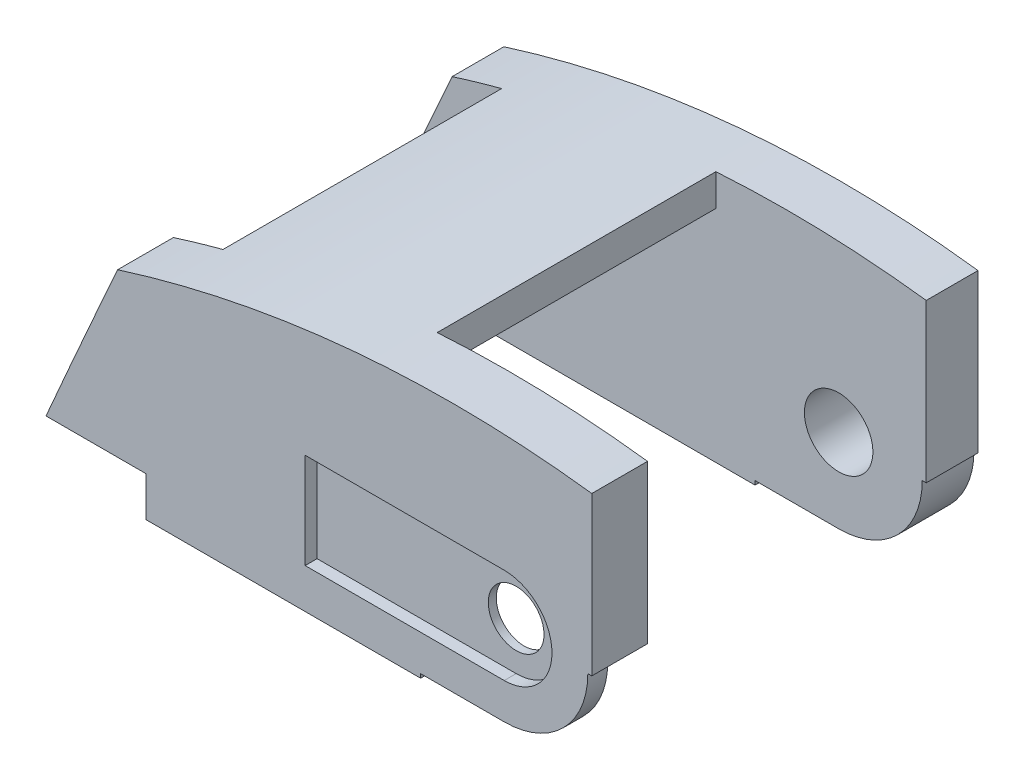
ISO-10303-21;
HEADER;
FILE_DESCRIPTION(('STEP AP214'),'2;1');
FILE_NAME('part.step','',(''),(''),'','','');
FILE_SCHEMA(('AUTOMOTIVE_DESIGN { 1 0 10303 214 1 1 1 1 }'));
ENDSEC;
DATA;
#1=APPLICATION_CONTEXT('core data for automotive mechanical design processes');
#2=APPLICATION_PROTOCOL_DEFINITION('international standard','automotive_design',2000,#1);
#3=PRODUCT_CONTEXT('',#1,'mechanical');
#4=PRODUCT('Part','Part','',(#3));
#5=PRODUCT_RELATED_PRODUCT_CATEGORY('part','',(#4));
#6=PRODUCT_DEFINITION_FORMATION('','',#4);
#7=PRODUCT_DEFINITION_CONTEXT('part definition',#1,'design');
#8=PRODUCT_DEFINITION('design','',#6,#7);
#9=PRODUCT_DEFINITION_SHAPE('','',#8);
#10=(LENGTH_UNIT() NAMED_UNIT(*) SI_UNIT(.MILLI.,.METRE.));
#11=(NAMED_UNIT(*) PLANE_ANGLE_UNIT() SI_UNIT($,.RADIAN.));
#12=(NAMED_UNIT(*) SI_UNIT($,.STERADIAN.) SOLID_ANGLE_UNIT());
#13=UNCERTAINTY_MEASURE_WITH_UNIT(LENGTH_MEASURE(1.E-05),#10,'distance_accuracy_value','');
#14=(GEOMETRIC_REPRESENTATION_CONTEXT(3) GLOBAL_UNCERTAINTY_ASSIGNED_CONTEXT((#13)) GLOBAL_UNIT_ASSIGNED_CONTEXT((#10,
#11,#12)) REPRESENTATION_CONTEXT('',''));
#15=CARTESIAN_POINT('',(0.,0.,0.));
#16=DIRECTION('',(0.,0.,1.));
#17=DIRECTION('',(1.,0.,0.));
#18=AXIS2_PLACEMENT_3D('',#15,#16,#17);
#19=CARTESIAN_POINT('',(0.,0.,-21.75));
#20=DIRECTION('',(0.,0.,1.));
#21=DIRECTION('',(-1.,0.,0.));
#22=AXIS2_PLACEMENT_3D('',#19,#20,#21);
#23=CYLINDRICAL_SURFACE('',#22,3.5);
#24=CARTESIAN_POINT('',(0.,0.,-2.5));
#25=DIRECTION('',(0.,0.,1.));
#26=DIRECTION('',(0.,-1.,0.));
#27=AXIS2_PLACEMENT_3D('',#24,#25,#26);
#28=CIRCLE('',#27,3.5);
#29=CARTESIAN_POINT('',(0.,-3.5,-2.5));
#30=VERTEX_POINT('',#29);
#31=EDGE_CURVE('E311',#30,#30,#28,.T.);
#32=ORIENTED_EDGE('',*,*,#31,.F.);
#33=EDGE_LOOP('',(#32));
#34=FACE_BOUND('',#33,.T.);
#35=CARTESIAN_POINT('',(0.,0.,-1.5));
#36=DIRECTION('',(0.,0.,-1.));
#37=DIRECTION('',(-1.,0.,0.));
#38=AXIS2_PLACEMENT_3D('',#35,#36,#37);
#39=CIRCLE('',#38,3.5);
#40=CARTESIAN_POINT('',(-3.5,0.,-1.5));
#41=VERTEX_POINT('',#40);
#42=EDGE_CURVE('E53',#41,#41,#39,.F.);
#43=ORIENTED_EDGE('',*,*,#42,.T.);
#44=EDGE_LOOP('',(#43));
#45=FACE_BOUND('',#44,.T.);
#46=ADVANCED_FACE('F49',(#34,#45),#23,.F.);
#47=CARTESIAN_POINT('',(12.,-12.,-7.));
#48=DIRECTION('',(0.,0.,1.));
#49=DIRECTION('',(0.,-1.,0.));
#50=AXIS2_PLACEMENT_3D('',#47,#48,#49);
#51=PLANE('',#50);
#52=CARTESIAN_POINT('',(0.,0.,-7.));
#53=DIRECTION('',(0.,0.,-1.));
#54=DIRECTION('',(0.,1.,0.));
#55=AXIS2_PLACEMENT_3D('',#52,#53,#54);
#56=CIRCLE('',#55,9.5);
#57=CARTESIAN_POINT('',(-9.5,0.,-7.));
#58=VERTEX_POINT('',#57);
#59=CARTESIAN_POINT('',(9.5,0.,-7.));
#60=VERTEX_POINT('',#59);
#61=EDGE_CURVE('E546',#58,#60,#56,.T.);
#62=ORIENTED_EDGE('',*,*,#61,.F.);
#63=DIRECTION('',(0.,1.,0.));
#64=VECTOR('',#63,1.);
#65=CARTESIAN_POINT('',(-9.5,-12.,-7.));
#66=LINE('',#65,#64);
#67=CARTESIAN_POINT('',(-9.5,-10.5,-7.00000000000001));
#68=VERTEX_POINT('',#67);
#69=EDGE_CURVE('E324',#68,#58,#66,.T.);
#70=ORIENTED_EDGE('',*,*,#69,.F.);
#71=DIRECTION('',(-1.,0.,0.));
#72=VECTOR('',#71,1.);
#73=CARTESIAN_POINT('',(12.,-10.5,-7.));
#74=LINE('',#73,#72);
#75=CARTESIAN_POINT('',(-10.5,-10.5,-7.00000000000001));
#76=VERTEX_POINT('',#75);
#77=EDGE_CURVE('E395',#68,#76,#74,.T.);
#78=ORIENTED_EDGE('',*,*,#77,.T.);
#79=DIRECTION('',(0.,-1.,0.));
#80=VECTOR('',#79,1.);
#81=CARTESIAN_POINT('',(-10.5,-12.,-7.));
#82=LINE('',#81,#80);
#83=CARTESIAN_POINT('',(-10.5,-11.,-7.00000000000001));
#84=VERTEX_POINT('',#83);
#85=EDGE_CURVE('E391',#76,#84,#82,.T.);
#86=ORIENTED_EDGE('',*,*,#85,.T.);
#87=DIRECTION('',(-1.,0.,0.));
#88=VECTOR('',#87,1.);
#89=CARTESIAN_POINT('',(0.,-11.,-7.));
#90=LINE('',#89,#88);
#91=CARTESIAN_POINT('',(-45.,-11.,-6.99999999999999));
#92=VERTEX_POINT('',#91);
#93=EDGE_CURVE('E522',#84,#92,#90,.T.);
#94=ORIENTED_EDGE('',*,*,#93,.T.);
#95=DIRECTION('',(0.,1.,0.));
#96=VECTOR('',#95,1.);
#97=CARTESIAN_POINT('',(-45.,-12.,-7.));
#98=LINE('',#97,#96);
#99=CARTESIAN_POINT('',(-45.,-6.00000000000001,-7.));
#100=VERTEX_POINT('',#99);
#101=EDGE_CURVE('E505',#92,#100,#98,.T.);
#102=ORIENTED_EDGE('',*,*,#101,.T.);
#103=DIRECTION('',(-1.,0.,0.));
#104=VECTOR('',#103,1.);
#105=CARTESIAN_POINT('',(12.,-6.00000000000001,-7.));
#106=LINE('',#105,#104);
#107=CARTESIAN_POINT('',(-57.544,-6.00000000000001,-7.));
#108=VERTEX_POINT('',#107);
#109=EDGE_CURVE('E501',#100,#108,#106,.T.);
#110=ORIENTED_EDGE('',*,*,#109,.T.);
#111=CARTESIAN_POINT('',(1474.51463993777,-669.474162441972,-7.));
#112=DIRECTION('',(0.,0.,-1.));
#113=DIRECTION('',(-1.,0.,0.));
#114=AXIS2_PLACEMENT_3D('',#111,#112,#113);
#115=CIRCLE('',#114,1669.55132908098);
#116=CARTESIAN_POINT('',(-48.5440000000004,14.4074206899005,-7.));
#117=VERTEX_POINT('',#116);
#118=EDGE_CURVE('E561',#108,#117,#115,.T.);
#119=ORIENTED_EDGE('',*,*,#118,.T.);
#120=CARTESIAN_POINT('',(-6.37755228058483,-118.72612320149,-7.00000000000001));
#121=DIRECTION('',(0.,0.,-1.));
#122=DIRECTION('',(-1.,0.,0.));
#123=AXIS2_PLACEMENT_3D('',#120,#121,#122);
#124=CIRCLE('',#123,139.651529967828);
#125=CARTESIAN_POINT('',(-42.3185543882278,16.2212524300997,-7.00000000000001));
#126=VERTEX_POINT('',#125);
#127=EDGE_CURVE('E419',#126,#117,#124,.F.);
#128=ORIENTED_EDGE('',*,*,#127,.F.);
#129=DIRECTION('',(0.,-1.,0.));
#130=VECTOR('',#129,1.);
#131=CARTESIAN_POINT('',(-42.3185543882278,23.1968454989127,-7.));
#132=LINE('',#131,#130);
#133=CARTESIAN_POINT('',(-42.3185543882278,10.887159644469,-7.));
#134=VERTEX_POINT('',#133);
#135=EDGE_CURVE('E399',#126,#134,#132,.T.);
#136=ORIENTED_EDGE('',*,*,#135,.T.);
#137=CARTESIAN_POINT('',(-6.54760474938378,-90.7897246312211,-6.99999999999999));
#138=DIRECTION('',(0.,0.,-1.));
#139=DIRECTION('',(0.,1.,0.));
#140=AXIS2_PLACEMENT_3D('',#137,#138,#139);
#141=CIRCLE('',#140,107.785665253209);
#142=CARTESIAN_POINT('',(-15.4186813659914,16.6302624928661,-7.));
#143=VERTEX_POINT('',#142);
#144=EDGE_CURVE('E453',#143,#134,#141,.F.);
#145=ORIENTED_EDGE('',*,*,#144,.F.);
#146=DIRECTION('',(0.,1.,0.));
#147=VECTOR('',#146,1.);
#148=CARTESIAN_POINT('',(-15.4186813659914,25.0924741347079,-7.));
#149=LINE('',#148,#147);
#150=CARTESIAN_POINT('',(-15.4186813659914,20.6324352268174,-7.00000000000001));
#151=VERTEX_POINT('',#150);
#152=EDGE_CURVE('E404',#143,#151,#149,.T.);
#153=ORIENTED_EDGE('',*,*,#152,.T.);
#154=CARTESIAN_POINT('',(-6.37755228058483,-118.72612320149,-7.00000000000001));
#155=DIRECTION('',(0.,0.,-1.));
#156=DIRECTION('',(-1.,0.,0.));
#157=AXIS2_PLACEMENT_3D('',#154,#155,#156);
#158=CIRCLE('',#157,139.651529967828);
#159=CARTESIAN_POINT('',(11.,19.84,-7.00000000000001));
#160=VERTEX_POINT('',#159);
#161=EDGE_CURVE('E430',#160,#151,#158,.F.);
#162=ORIENTED_EDGE('',*,*,#161,.F.);
#163=DIRECTION('',(0.,-1.,0.));
#164=VECTOR('',#163,1.);
#165=CARTESIAN_POINT('',(11.,-12.,-7.));
#166=LINE('',#165,#164);
#167=CARTESIAN_POINT('',(11.,0.,-7.00000000000003));
#168=VERTEX_POINT('',#167);
#169=EDGE_CURVE('E541',#160,#168,#166,.T.);
#170=ORIENTED_EDGE('',*,*,#169,.T.);
#171=DIRECTION('',(-1.,0.,0.));
#172=VECTOR('',#171,1.);
#173=CARTESIAN_POINT('',(12.,0.,-7.));
#174=LINE('',#173,#172);
#175=EDGE_CURVE('E383',#168,#60,#174,.T.);
#176=ORIENTED_EDGE('',*,*,#175,.T.);
#177=EDGE_LOOP('',(#62,#70,#78,#86,#94,#102,#110,#119,#128,#136,#145,#153,#162,#170,#176));
#178=FACE_BOUND('',#177,.T.);
#179=ADVANCED_FACE('F605',(#178),#51,.F.);
#180=CARTESIAN_POINT('',(0.,0.,0.));
#181=DIRECTION('',(0.,0.,1.));
#182=DIRECTION('',(1.,0.,0.));
#183=AXIS2_PLACEMENT_3D('',#180,#181,#182);
#184=PLANE('',#183);
#185=CARTESIAN_POINT('',(0.,0.,0.));
#186=DIRECTION('',(0.,0.,-1.));
#187=DIRECTION('',(-1.,0.,0.));
#188=AXIS2_PLACEMENT_3D('',#185,#186,#187);
#189=CIRCLE('',#188,6.);
#190=CARTESIAN_POINT('',(0.,6.,0.));
#191=VERTEX_POINT('',#190);
#192=CARTESIAN_POINT('',(0.,-6.,0.));
#193=VERTEX_POINT('',#192);
#194=EDGE_CURVE('E291',#191,#193,#189,.T.);
#195=ORIENTED_EDGE('',*,*,#194,.T.);
#196=DIRECTION('',(-1.,0.,0.));
#197=VECTOR('',#196,1.);
#198=CARTESIAN_POINT('',(0.,-6.,0.));
#199=LINE('',#198,#197);
#200=CARTESIAN_POINT('',(-25.,-6.,0.));
#201=VERTEX_POINT('',#200);
#202=EDGE_CURVE('E260',#193,#201,#199,.T.);
#203=ORIENTED_EDGE('',*,*,#202,.T.);
#204=DIRECTION('',(0.,1.,0.));
#205=VECTOR('',#204,1.);
#206=CARTESIAN_POINT('',(-25.,6.,0.));
#207=LINE('',#206,#205);
#208=CARTESIAN_POINT('',(-25.,6.,0.));
#209=VERTEX_POINT('',#208);
#210=EDGE_CURVE('E284',#201,#209,#207,.T.);
#211=ORIENTED_EDGE('',*,*,#210,.T.);
#212=DIRECTION('',(1.,0.,0.));
#213=VECTOR('',#212,1.);
#214=CARTESIAN_POINT('',(0.,6.,0.));
#215=LINE('',#214,#213);
#216=EDGE_CURVE('E280',#209,#191,#215,.T.);
#217=ORIENTED_EDGE('',*,*,#216,.T.);
#218=EDGE_LOOP('',(#195,#203,#211,#217));
#219=FACE_BOUND('',#218,.T.);
#220=DIRECTION('',(-1.,0.,0.));
#221=VECTOR('',#220,1.);
#222=CARTESIAN_POINT('',(0.,-10.5,0.));
#223=LINE('',#222,#221);
#224=CARTESIAN_POINT('',(0.,-10.5,0.));
#225=VERTEX_POINT('',#224);
#226=CARTESIAN_POINT('',(-10.5,-10.5,0.));
#227=VERTEX_POINT('',#226);
#228=EDGE_CURVE('E338',#225,#227,#223,.T.);
#229=ORIENTED_EDGE('',*,*,#228,.F.);
#230=CARTESIAN_POINT('',(0.,0.,0.));
#231=DIRECTION('',(0.,0.,-1.));
#232=DIRECTION('',(-1.,0.,0.));
#233=AXIS2_PLACEMENT_3D('',#230,#231,#232);
#234=CIRCLE('',#233,10.5);
#235=CARTESIAN_POINT('',(10.5,0.,0.));
#236=VERTEX_POINT('',#235);
#237=EDGE_CURVE('E351',#236,#225,#234,.T.);
#238=ORIENTED_EDGE('',*,*,#237,.F.);
#239=DIRECTION('',(-1.,0.,0.));
#240=VECTOR('',#239,1.);
#241=CARTESIAN_POINT('',(0.,0.,0.));
#242=LINE('',#241,#240);
#243=CARTESIAN_POINT('',(11.,0.,0.));
#244=VERTEX_POINT('',#243);
#245=EDGE_CURVE('E354',#244,#236,#242,.T.);
#246=ORIENTED_EDGE('',*,*,#245,.F.);
#247=DIRECTION('',(0.,-1.,0.));
#248=VECTOR('',#247,1.);
#249=CARTESIAN_POINT('',(11.,0.,0.));
#250=LINE('',#249,#248);
#251=CARTESIAN_POINT('',(11.,19.84,0.));
#252=VERTEX_POINT('',#251);
#253=EDGE_CURVE('E526',#252,#244,#250,.T.);
#254=ORIENTED_EDGE('',*,*,#253,.F.);
#255=CARTESIAN_POINT('',(-6.37755228058483,-118.72612320149,0.));
#256=DIRECTION('',(0.,0.,-1.));
#257=DIRECTION('',(-1.,0.,0.));
#258=AXIS2_PLACEMENT_3D('',#255,#256,#257);
#259=CIRCLE('',#258,139.651529967828);
#260=CARTESIAN_POINT('',(-48.544,14.4074206899005,0.));
#261=VERTEX_POINT('',#260);
#262=EDGE_CURVE('E469',#261,#252,#259,.T.);
#263=ORIENTED_EDGE('',*,*,#262,.F.);
#264=CARTESIAN_POINT('',(1474.51463993777,-669.474162441972,0.));
#265=DIRECTION('',(0.,0.,-1.));
#266=DIRECTION('',(-1.,0.,0.));
#267=AXIS2_PLACEMENT_3D('',#264,#265,#266);
#268=CIRCLE('',#267,1669.55132908098);
#269=CARTESIAN_POINT('',(-57.544,-6.00000000000001,0.));
#270=VERTEX_POINT('',#269);
#271=EDGE_CURVE('E437',#261,#270,#268,.F.);
#272=ORIENTED_EDGE('',*,*,#271,.T.);
#273=DIRECTION('',(1.,0.,0.));
#274=VECTOR('',#273,1.);
#275=CARTESIAN_POINT('',(-55.,-6.,0.));
#276=LINE('',#275,#274);
#277=CARTESIAN_POINT('',(-45.,-6.00000000000001,0.));
#278=VERTEX_POINT('',#277);
#279=EDGE_CURVE('E474',#270,#278,#276,.T.);
#280=ORIENTED_EDGE('',*,*,#279,.T.);
#281=DIRECTION('',(0.,-1.,0.));
#282=VECTOR('',#281,1.);
#283=CARTESIAN_POINT('',(-45.,-11.,0.));
#284=LINE('',#283,#282);
#285=CARTESIAN_POINT('',(-45.,-11.,0.));
#286=VERTEX_POINT('',#285);
#287=EDGE_CURVE('E478',#278,#286,#284,.T.);
#288=ORIENTED_EDGE('',*,*,#287,.T.);
#289=DIRECTION('',(-1.,0.,0.));
#290=VECTOR('',#289,1.);
#291=CARTESIAN_POINT('',(0.,-11.,0.));
#292=LINE('',#291,#290);
#293=CARTESIAN_POINT('',(-10.5,-11.,0.));
#294=VERTEX_POINT('',#293);
#295=EDGE_CURVE('E521',#294,#286,#292,.T.);
#296=ORIENTED_EDGE('',*,*,#295,.F.);
#297=DIRECTION('',(0.,-1.,0.));
#298=VECTOR('',#297,1.);
#299=CARTESIAN_POINT('',(-10.5,0.,0.));
#300=LINE('',#299,#298);
#301=EDGE_CURVE('E358',#227,#294,#300,.T.);
#302=ORIENTED_EDGE('',*,*,#301,.F.);
#303=EDGE_LOOP('',(#229,#238,#246,#254,#263,#272,#280,#288,#296,#302));
#304=FACE_BOUND('',#303,.T.);
#305=ADVANCED_FACE('F611',(#219,#304),#184,.T.);
#306=CARTESIAN_POINT('',(0.,0.,-48.5));
#307=DIRECTION('',(0.,0.,-1.));
#308=DIRECTION('',(-1.,0.,0.));
#309=AXIS2_PLACEMENT_3D('',#306,#307,#308);
#310=PLANE('',#309);
#311=CARTESIAN_POINT('',(0.,0.,-48.5));
#312=DIRECTION('',(0.,0.,-1.));
#313=DIRECTION('',(-1.,0.,0.));
#314=AXIS2_PLACEMENT_3D('',#311,#312,#313);
#315=CIRCLE('',#314,4.3);
#316=CARTESIAN_POINT('',(-4.3,0.,-48.5));
#317=VERTEX_POINT('',#316);
#318=EDGE_CURVE('E328',#317,#317,#315,.T.);
#319=ORIENTED_EDGE('',*,*,#318,.F.);
#320=EDGE_LOOP('',(#319));
#321=FACE_BOUND('',#320,.T.);
#322=DIRECTION('',(-1.,0.,0.));
#323=VECTOR('',#322,1.);
#324=CARTESIAN_POINT('',(0.,-11.,-48.5));
#325=LINE('',#324,#323);
#326=CARTESIAN_POINT('',(-10.5,-11.,-48.5));
#327=VERTEX_POINT('',#326);
#328=CARTESIAN_POINT('',(-45.,-11.,-48.5));
#329=VERTEX_POINT('',#328);
#330=EDGE_CURVE('E517',#327,#329,#325,.T.);
#331=ORIENTED_EDGE('',*,*,#330,.T.);
#332=DIRECTION('',(0.,-1.,0.));
#333=VECTOR('',#332,1.);
#334=CARTESIAN_POINT('',(-45.,-11.,-48.5));
#335=LINE('',#334,#333);
#336=CARTESIAN_POINT('',(-45.,-6.00000000000001,-48.5));
#337=VERTEX_POINT('',#336);
#338=EDGE_CURVE('E479',#337,#329,#335,.T.);
#339=ORIENTED_EDGE('',*,*,#338,.F.);
#340=DIRECTION('',(1.,0.,0.));
#341=VECTOR('',#340,1.);
#342=CARTESIAN_POINT('',(-55.,-6.,-48.5));
#343=LINE('',#342,#341);
#344=CARTESIAN_POINT('',(-57.544,-6.00000000000001,-48.5));
#345=VERTEX_POINT('',#344);
#346=EDGE_CURVE('E473',#345,#337,#343,.T.);
#347=ORIENTED_EDGE('',*,*,#346,.F.);
#348=CARTESIAN_POINT('',(1474.51463993777,-669.474162441972,-48.5));
#349=DIRECTION('',(0.,0.,-1.));
#350=DIRECTION('',(-1.,0.,0.));
#351=AXIS2_PLACEMENT_3D('',#348,#349,#350);
#352=CIRCLE('',#351,1669.55132908098);
#353=CARTESIAN_POINT('',(-48.544,14.4074206899005,-48.5));
#354=VERTEX_POINT('',#353);
#355=EDGE_CURVE('E441',#354,#345,#352,.F.);
#356=ORIENTED_EDGE('',*,*,#355,.F.);
#357=CARTESIAN_POINT('',(-6.37755228058483,-118.72612320149,-48.5));
#358=DIRECTION('',(0.,0.,1.));
#359=DIRECTION('',(1.,0.,0.));
#360=AXIS2_PLACEMENT_3D('',#357,#358,#359);
#361=CIRCLE('',#360,139.651529967828);
#362=CARTESIAN_POINT('',(11.,19.84,-48.5));
#363=VERTEX_POINT('',#362);
#364=EDGE_CURVE('E465',#363,#354,#361,.T.);
#365=ORIENTED_EDGE('',*,*,#364,.F.);
#366=DIRECTION('',(0.,-1.,0.));
#367=VECTOR('',#366,1.);
#368=CARTESIAN_POINT('',(11.,0.,-48.5));
#369=LINE('',#368,#367);
#370=CARTESIAN_POINT('',(11.,0.,-48.5));
#371=VERTEX_POINT('',#370);
#372=EDGE_CURVE('E530',#363,#371,#369,.T.);
#373=ORIENTED_EDGE('',*,*,#372,.T.);
#374=DIRECTION('',(-1.,0.,0.));
#375=VECTOR('',#374,1.);
#376=CARTESIAN_POINT('',(0.,0.,-48.5));
#377=LINE('',#376,#375);
#378=CARTESIAN_POINT('',(10.5,0.,-48.5));
#379=VERTEX_POINT('',#378);
#380=EDGE_CURVE('E337',#371,#379,#377,.T.);
#381=ORIENTED_EDGE('',*,*,#380,.T.);
#382=CARTESIAN_POINT('',(0.,0.,-48.5));
#383=DIRECTION('',(0.,0.,-1.));
#384=DIRECTION('',(-1.,0.,0.));
#385=AXIS2_PLACEMENT_3D('',#382,#383,#384);
#386=CIRCLE('',#385,10.5);
#387=CARTESIAN_POINT('',(0.,-10.5,-48.5));
#388=VERTEX_POINT('',#387);
#389=EDGE_CURVE('E333',#379,#388,#386,.T.);
#390=ORIENTED_EDGE('',*,*,#389,.T.);
#391=DIRECTION('',(-1.,0.,0.));
#392=VECTOR('',#391,1.);
#393=CARTESIAN_POINT('',(0.,-10.5,-48.5));
#394=LINE('',#393,#392);
#395=CARTESIAN_POINT('',(-10.5,-10.5,-48.5));
#396=VERTEX_POINT('',#395);
#397=EDGE_CURVE('E346',#388,#396,#394,.T.);
#398=ORIENTED_EDGE('',*,*,#397,.T.);
#399=DIRECTION('',(0.,-1.,0.));
#400=VECTOR('',#399,1.);
#401=CARTESIAN_POINT('',(-10.5,0.,-48.5));
#402=LINE('',#401,#400);
#403=EDGE_CURVE('E342',#396,#327,#402,.T.);
#404=ORIENTED_EDGE('',*,*,#403,.T.);
#405=EDGE_LOOP('',(#331,#339,#347,#356,#365,#373,#381,#390,#398,#404));
#406=FACE_BOUND('',#405,.T.);
#407=ADVANCED_FACE('F675',(#321,#406),#310,.T.);
#408=CARTESIAN_POINT('',(0.,0.,-42.));
#409=DIRECTION('',(0.,0.,1.));
#410=DIRECTION('',(1.,0.,0.));
#411=AXIS2_PLACEMENT_3D('',#408,#409,#410);
#412=PLANE('',#411);
#413=CARTESIAN_POINT('',(0.,0.,-42.));
#414=DIRECTION('',(0.,0.,-1.));
#415=DIRECTION('',(-1.,0.,0.));
#416=AXIS2_PLACEMENT_3D('',#413,#414,#415);
#417=CIRCLE('',#416,4.3);
#418=CARTESIAN_POINT('',(-4.3,0.,-42.));
#419=VERTEX_POINT('',#418);
#420=EDGE_CURVE('E332',#419,#419,#417,.T.);
#421=ORIENTED_EDGE('',*,*,#420,.T.);
#422=EDGE_LOOP('',(#421));
#423=FACE_BOUND('',#422,.T.);
#424=DIRECTION('',(-1.,0.,0.));
#425=VECTOR('',#424,1.);
#426=CARTESIAN_POINT('',(0.,-10.5,-42.));
#427=LINE('',#426,#425);
#428=CARTESIAN_POINT('',(0.,-10.5,-42.));
#429=VERTEX_POINT('',#428);
#430=CARTESIAN_POINT('',(-10.5,-10.5,-42.));
#431=VERTEX_POINT('',#430);
#432=EDGE_CURVE('E575',#429,#431,#427,.T.);
#433=ORIENTED_EDGE('',*,*,#432,.F.);
#434=CARTESIAN_POINT('',(0.,0.,-42.));
#435=DIRECTION('',(0.,0.,-1.));
#436=DIRECTION('',(-1.,0.,0.));
#437=AXIS2_PLACEMENT_3D('',#434,#435,#436);
#438=CIRCLE('',#437,10.5);
#439=CARTESIAN_POINT('',(10.5,0.,-42.));
#440=VERTEX_POINT('',#439);
#441=EDGE_CURVE('E571',#440,#429,#438,.T.);
#442=ORIENTED_EDGE('',*,*,#441,.F.);
#443=DIRECTION('',(-1.,0.,0.));
#444=VECTOR('',#443,1.);
#445=CARTESIAN_POINT('',(0.,0.,-42.));
#446=LINE('',#445,#444);
#447=CARTESIAN_POINT('',(11.,0.,-42.));
#448=VERTEX_POINT('',#447);
#449=EDGE_CURVE('E368',#448,#440,#446,.T.);
#450=ORIENTED_EDGE('',*,*,#449,.F.);
#451=DIRECTION('',(0.,1.,0.));
#452=VECTOR('',#451,1.);
#453=CARTESIAN_POINT('',(11.,0.,-42.));
#454=LINE('',#453,#452);
#455=CARTESIAN_POINT('',(11.,19.84,-42.));
#456=VERTEX_POINT('',#455);
#457=EDGE_CURVE('E509',#448,#456,#454,.T.);
#458=ORIENTED_EDGE('',*,*,#457,.T.);
#459=CARTESIAN_POINT('',(-6.37755228058483,-118.72612320149,-42.));
#460=DIRECTION('',(0.,0.,-1.));
#461=DIRECTION('',(-1.,0.,0.));
#462=AXIS2_PLACEMENT_3D('',#459,#460,#461);
#463=CIRCLE('',#462,139.651529967828);
#464=CARTESIAN_POINT('',(-15.4186813659914,20.6324352268174,-42.));
#465=VERTEX_POINT('',#464);
#466=EDGE_CURVE('E426',#456,#465,#463,.F.);
#467=ORIENTED_EDGE('',*,*,#466,.T.);
#468=DIRECTION('',(0.,1.,0.));
#469=VECTOR('',#468,1.);
#470=CARTESIAN_POINT('',(-15.4186813659914,25.0924741347079,-42.));
#471=LINE('',#470,#469);
#472=CARTESIAN_POINT('',(-15.4186813659914,16.6302624928661,-42.));
#473=VERTEX_POINT('',#472);
#474=EDGE_CURVE('E400',#473,#465,#471,.T.);
#475=ORIENTED_EDGE('',*,*,#474,.F.);
#476=CARTESIAN_POINT('',(-6.54760474938378,-90.7897246312211,-42.));
#477=DIRECTION('',(0.,0.,-1.));
#478=DIRECTION('',(-1.,0.,0.));
#479=AXIS2_PLACEMENT_3D('',#476,#477,#478);
#480=CIRCLE('',#479,107.785665253209);
#481=CARTESIAN_POINT('',(-42.3185543882278,10.887159644469,-42.));
#482=VERTEX_POINT('',#481);
#483=EDGE_CURVE('E449',#473,#482,#480,.F.);
#484=ORIENTED_EDGE('',*,*,#483,.T.);
#485=DIRECTION('',(0.,-1.,0.));
#486=VECTOR('',#485,1.);
#487=CARTESIAN_POINT('',(-42.3185543882278,23.1968454989127,-42.));
#488=LINE('',#487,#486);
#489=CARTESIAN_POINT('',(-42.3185543882278,16.2212524300997,-42.));
#490=VERTEX_POINT('',#489);
#491=EDGE_CURVE('E405',#490,#482,#488,.T.);
#492=ORIENTED_EDGE('',*,*,#491,.F.);
#493=CARTESIAN_POINT('',(-6.37755228058483,-118.72612320149,-42.));
#494=DIRECTION('',(0.,0.,-1.));
#495=DIRECTION('',(-1.,0.,0.));
#496=AXIS2_PLACEMENT_3D('',#493,#494,#495);
#497=CIRCLE('',#496,139.651529967828);
#498=CARTESIAN_POINT('',(-48.5440000000004,14.4074206899005,-42.));
#499=VERTEX_POINT('',#498);
#500=EDGE_CURVE('E409',#490,#499,#497,.F.);
#501=ORIENTED_EDGE('',*,*,#500,.T.);
#502=CARTESIAN_POINT('',(1474.51463993777,-669.474162441972,-42.));
#503=DIRECTION('',(0.,0.,-1.));
#504=DIRECTION('',(-1.,0.,0.));
#505=AXIS2_PLACEMENT_3D('',#502,#503,#504);
#506=CIRCLE('',#505,1669.55132908098);
#507=CARTESIAN_POINT('',(-57.544,-6.00000000000001,-42.));
#508=VERTEX_POINT('',#507);
#509=EDGE_CURVE('E557',#508,#499,#506,.T.);
#510=ORIENTED_EDGE('',*,*,#509,.F.);
#511=DIRECTION('',(-1.,0.,0.));
#512=VECTOR('',#511,1.);
#513=CARTESIAN_POINT('',(0.,-6.00000000000001,-42.));
#514=LINE('',#513,#512);
#515=CARTESIAN_POINT('',(-45.,-6.00000000000001,-42.));
#516=VERTEX_POINT('',#515);
#517=EDGE_CURVE('E493',#516,#508,#514,.T.);
#518=ORIENTED_EDGE('',*,*,#517,.F.);
#519=DIRECTION('',(0.,1.,0.));
#520=VECTOR('',#519,1.);
#521=CARTESIAN_POINT('',(-45.,0.,-42.));
#522=LINE('',#521,#520);
#523=CARTESIAN_POINT('',(-45.,-11.,-42.));
#524=VERTEX_POINT('',#523);
#525=EDGE_CURVE('E550',#524,#516,#522,.T.);
#526=ORIENTED_EDGE('',*,*,#525,.F.);
#527=DIRECTION('',(1.,0.,0.));
#528=VECTOR('',#527,1.);
#529=CARTESIAN_POINT('',(0.,-11.,-42.));
#530=LINE('',#529,#528);
#531=CARTESIAN_POINT('',(-10.5,-11.,-42.));
#532=VERTEX_POINT('',#531);
#533=EDGE_CURVE('E513',#524,#532,#530,.T.);
#534=ORIENTED_EDGE('',*,*,#533,.T.);
#535=DIRECTION('',(0.,-1.,0.));
#536=VECTOR('',#535,1.);
#537=CARTESIAN_POINT('',(-10.5,0.,-42.));
#538=LINE('',#537,#536);
#539=EDGE_CURVE('E387',#431,#532,#538,.T.);
#540=ORIENTED_EDGE('',*,*,#539,.F.);
#541=EDGE_LOOP('',(#433,#442,#450,#458,#467,#475,#484,#492,#501,#510,#518,#526,#534,#540));
#542=FACE_BOUND('',#541,.T.);
#543=ADVANCED_FACE('F671',(#423,#542),#412,.T.);
#544=CARTESIAN_POINT('',(0.,-11.,-7.));
#545=DIRECTION('',(0.,1.,0.));
#546=DIRECTION('',(-1.,0.,0.));
#547=AXIS2_PLACEMENT_3D('',#544,#545,#546);
#548=PLANE('',#547);
#549=DIRECTION('',(0.,0.,1.));
#550=VECTOR('',#549,1.);
#551=CARTESIAN_POINT('',(-10.5,-11.,-48.5));
#552=LINE('',#551,#550);
#553=EDGE_CURVE('E373',#327,#532,#552,.T.);
#554=ORIENTED_EDGE('',*,*,#553,.T.);
#555=ORIENTED_EDGE('',*,*,#533,.F.);
#556=DIRECTION('',(0.,0.,-1.));
#557=VECTOR('',#556,1.);
#558=CARTESIAN_POINT('',(-45.,-11.,0.));
#559=LINE('',#558,#557);
#560=EDGE_CURVE('E494',#524,#329,#559,.T.);
#561=ORIENTED_EDGE('',*,*,#560,.T.);
#562=ORIENTED_EDGE('',*,*,#330,.F.);
#563=EDGE_LOOP('',(#554,#555,#561,#562));
#564=FACE_BOUND('',#563,.T.);
#565=ADVANCED_FACE('F674',(#564),#548,.F.);
#566=EDGE_CURVE('E376',#84,#294,#552,.T.);
#567=ORIENTED_EDGE('',*,*,#566,.T.);
#568=ORIENTED_EDGE('',*,*,#295,.T.);
#569=EDGE_CURVE('E490',#286,#92,#559,.T.);
#570=ORIENTED_EDGE('',*,*,#569,.T.);
#571=ORIENTED_EDGE('',*,*,#93,.F.);
#572=EDGE_LOOP('',(#567,#568,#570,#571));
#573=FACE_BOUND('',#572,.T.);
#574=ADVANCED_FACE('F679',(#573),#548,.F.);
#575=CARTESIAN_POINT('',(11.,0.,-48.5));
#576=DIRECTION('',(-1.,0.,0.));
#577=DIRECTION('',(0.,0.,1.));
#578=AXIS2_PLACEMENT_3D('',#575,#576,#577);
#579=PLANE('',#578);
#580=ORIENTED_EDGE('',*,*,#457,.F.);
#581=DIRECTION('',(0.,0.,1.));
#582=VECTOR('',#581,1.);
#583=CARTESIAN_POINT('',(11.,0.,-48.5));
#584=LINE('',#583,#582);
#585=EDGE_CURVE('E538',#371,#448,#584,.T.);
#586=ORIENTED_EDGE('',*,*,#585,.F.);
#587=ORIENTED_EDGE('',*,*,#372,.F.);
#588=DIRECTION('',(0.,0.,1.));
#589=VECTOR('',#588,1.);
#590=CARTESIAN_POINT('',(11.,19.84,-214.866061332315));
#591=LINE('',#590,#589);
#592=EDGE_CURVE('E462',#363,#456,#591,.T.);
#593=ORIENTED_EDGE('',*,*,#592,.T.);
#594=EDGE_LOOP('',(#580,#586,#587,#593));
#595=FACE_BOUND('',#594,.T.);
#596=ADVANCED_FACE('F685',(#595),#579,.F.);
#597=CARTESIAN_POINT('',(-55.,-6.,0.));
#598=DIRECTION('',(0.,1.,0.));
#599=DIRECTION('',(-1.,0.,0.));
#600=AXIS2_PLACEMENT_3D('',#597,#598,#599);
#601=PLANE('',#600);
#602=DIRECTION('',(0.,0.,1.));
#603=VECTOR('',#602,1.);
#604=CARTESIAN_POINT('',(-57.544,-6.00000000000001,-48.5));
#605=LINE('',#604,#603);
#606=EDGE_CURVE('E446',#345,#508,#605,.T.);
#607=ORIENTED_EDGE('',*,*,#606,.F.);
#608=ORIENTED_EDGE('',*,*,#346,.T.);
#609=DIRECTION('',(0.,0.,-1.));
#610=VECTOR('',#609,1.);
#611=CARTESIAN_POINT('',(-45.,-6.00000000000001,0.));
#612=LINE('',#611,#610);
#613=EDGE_CURVE('E483',#516,#337,#612,.T.);
#614=ORIENTED_EDGE('',*,*,#613,.F.);
#615=ORIENTED_EDGE('',*,*,#517,.T.);
#616=EDGE_LOOP('',(#607,#608,#614,#615));
#617=FACE_BOUND('',#616,.T.);
#618=ADVANCED_FACE('F656',(#617),#601,.F.);
#619=CARTESIAN_POINT('',(-6.54760474938378,-90.7897246312211,-48.5));
#620=DIRECTION('',(0.,0.,1.));
#621=DIRECTION('',(-1.,0.,0.));
#622=AXIS2_PLACEMENT_3D('',#619,#620,#621);
#623=CYLINDRICAL_SURFACE('',#622,107.785665253209);
#624=ORIENTED_EDGE('',*,*,#144,.T.);
#625=DIRECTION('',(0.,0.,1.));
#626=VECTOR('',#625,1.);
#627=CARTESIAN_POINT('',(-42.3185543882278,10.887159644469,-48.5));
#628=LINE('',#627,#626);
#629=EDGE_CURVE('E565',#482,#134,#628,.T.);
#630=ORIENTED_EDGE('',*,*,#629,.F.);
#631=ORIENTED_EDGE('',*,*,#483,.F.);
#632=DIRECTION('',(0.,0.,1.));
#633=VECTOR('',#632,1.);
#634=CARTESIAN_POINT('',(-15.4186813659914,16.6302624928661,-48.5));
#635=LINE('',#634,#633);
#636=EDGE_CURVE('E568',#143,#473,#635,.F.);
#637=ORIENTED_EDGE('',*,*,#636,.F.);
#638=EDGE_LOOP('',(#624,#630,#631,#637));
#639=FACE_BOUND('',#638,.T.);
#640=ADVANCED_FACE('F653',(#639),#623,.F.);
#641=CARTESIAN_POINT('',(1474.51463993777,-669.474162441972,-48.5));
#642=DIRECTION('',(0.,0.,1.));
#643=DIRECTION('',(-1.,0.,0.));
#644=AXIS2_PLACEMENT_3D('',#641,#642,#643);
#645=CYLINDRICAL_SURFACE('',#644,1669.55132908098);
#646=ORIENTED_EDGE('',*,*,#509,.T.);
#647=DIRECTION('',(0.,0.,1.));
#648=VECTOR('',#647,1.);
#649=CARTESIAN_POINT('',(-48.544,14.4074206899005,-214.866061332315));
#650=LINE('',#649,#648);
#651=EDGE_CURVE('E458',#354,#499,#650,.T.);
#652=ORIENTED_EDGE('',*,*,#651,.F.);
#653=ORIENTED_EDGE('',*,*,#355,.T.);
#654=ORIENTED_EDGE('',*,*,#606,.T.);
#655=EDGE_LOOP('',(#646,#652,#653,#654));
#656=FACE_BOUND('',#655,.T.);
#657=ADVANCED_FACE('F652',(#656),#645,.T.);
#658=EDGE_CURVE('E461',#160,#252,#591,.T.);
#659=ORIENTED_EDGE('',*,*,#658,.T.);
#660=ORIENTED_EDGE('',*,*,#253,.T.);
#661=EDGE_CURVE('E534',#168,#244,#584,.T.);
#662=ORIENTED_EDGE('',*,*,#661,.F.);
#663=ORIENTED_EDGE('',*,*,#169,.F.);
#664=EDGE_LOOP('',(#659,#660,#662,#663));
#665=FACE_BOUND('',#664,.T.);
#666=ADVANCED_FACE('F681',(#665),#579,.F.);
#667=CARTESIAN_POINT('',(0.,0.,-2.5));
#668=DIRECTION('',(0.,0.,-1.));
#669=DIRECTION('',(0.,1.,0.));
#670=AXIS2_PLACEMENT_3D('',#667,#668,#669);
#671=PLANE('',#670);
#672=ORIENTED_EDGE('',*,*,#31,.T.);
#673=EDGE_LOOP('',(#672));
#674=FACE_BOUND('',#673,.T.);
#675=CARTESIAN_POINT('',(0.,0.,-2.5));
#676=DIRECTION('',(0.,0.,-1.));
#677=DIRECTION('',(0.,1.,0.));
#678=AXIS2_PLACEMENT_3D('',#675,#676,#677);
#679=CIRCLE('',#678,9.5);
#680=CARTESIAN_POINT('',(-9.5,0.,-2.5));
#681=VERTEX_POINT('',#680);
#682=CARTESIAN_POINT('',(9.5,0.,-2.5));
#683=VERTEX_POINT('',#682);
#684=EDGE_CURVE('E545',#681,#683,#679,.T.);
#685=ORIENTED_EDGE('',*,*,#684,.T.);
#686=DIRECTION('',(-1.,0.,0.));
#687=VECTOR('',#686,1.);
#688=CARTESIAN_POINT('',(0.,0.,-2.5));
#689=LINE('',#688,#687);
#690=CARTESIAN_POINT('',(10.5,0.,-2.5));
#691=VERTEX_POINT('',#690);
#692=EDGE_CURVE('E306',#691,#683,#689,.T.);
#693=ORIENTED_EDGE('',*,*,#692,.F.);
#694=CARTESIAN_POINT('',(0.,0.,-2.5));
#695=DIRECTION('',(0.,0.,-1.));
#696=DIRECTION('',(-1.,0.,0.));
#697=AXIS2_PLACEMENT_3D('',#694,#695,#696);
#698=CIRCLE('',#697,10.5);
#699=CARTESIAN_POINT('',(0.,-10.5,-2.50000000000002));
#700=VERTEX_POINT('',#699);
#701=EDGE_CURVE('E59',#700,#691,#698,.F.);
#702=ORIENTED_EDGE('',*,*,#701,.F.);
#703=DIRECTION('',(1.,0.,0.));
#704=VECTOR('',#703,1.);
#705=CARTESIAN_POINT('',(0.,-10.5,-2.5));
#706=LINE('',#705,#704);
#707=CARTESIAN_POINT('',(-9.5,-10.5,-2.5));
#708=VERTEX_POINT('',#707);
#709=EDGE_CURVE('E321',#708,#700,#706,.T.);
#710=ORIENTED_EDGE('',*,*,#709,.F.);
#711=DIRECTION('',(0.,-1.,0.));
#712=VECTOR('',#711,1.);
#713=CARTESIAN_POINT('',(-9.5,0.,-2.5));
#714=LINE('',#713,#712);
#715=EDGE_CURVE('E310',#681,#708,#714,.T.);
#716=ORIENTED_EDGE('',*,*,#715,.F.);
#717=EDGE_LOOP('',(#685,#693,#702,#710,#716));
#718=FACE_BOUND('',#717,.T.);
#719=ADVANCED_FACE('F51',(#674,#718),#671,.T.);
#720=CARTESIAN_POINT('',(0.,0.,-2.5));
#721=DIRECTION('',(0.,0.,-1.));
#722=DIRECTION('',(0.,1.,0.));
#723=AXIS2_PLACEMENT_3D('',#720,#721,#722);
#724=CYLINDRICAL_SURFACE('',#723,9.5);
#725=ORIENTED_EDGE('',*,*,#684,.F.);
#726=DIRECTION('',(0.,0.,-1.));
#727=VECTOR('',#726,1.);
#728=CARTESIAN_POINT('',(-9.5,0.,-2.5));
#729=LINE('',#728,#727);
#730=EDGE_CURVE('E315',#681,#58,#729,.T.);
#731=ORIENTED_EDGE('',*,*,#730,.T.);
#732=ORIENTED_EDGE('',*,*,#61,.T.);
#733=DIRECTION('',(0.,0.,-1.));
#734=VECTOR('',#733,1.);
#735=CARTESIAN_POINT('',(9.5,0.,-2.5));
#736=LINE('',#735,#734);
#737=EDGE_CURVE('E318',#683,#60,#736,.T.);
#738=ORIENTED_EDGE('',*,*,#737,.F.);
#739=EDGE_LOOP('',(#725,#731,#732,#738));
#740=FACE_BOUND('',#739,.T.);
#741=ADVANCED_FACE('F666',(#740),#724,.F.);
#742=CARTESIAN_POINT('',(-45.,-11.,0.));
#743=DIRECTION('',(1.,0.,0.));
#744=DIRECTION('',(0.,0.,-1.));
#745=AXIS2_PLACEMENT_3D('',#742,#743,#744);
#746=PLANE('',#745);
#747=ORIENTED_EDGE('',*,*,#525,.T.);
#748=ORIENTED_EDGE('',*,*,#613,.T.);
#749=ORIENTED_EDGE('',*,*,#338,.T.);
#750=ORIENTED_EDGE('',*,*,#560,.F.);
#751=EDGE_LOOP('',(#747,#748,#749,#750));
#752=FACE_BOUND('',#751,.T.);
#753=ADVANCED_FACE('F662',(#752),#746,.F.);
#754=ORIENTED_EDGE('',*,*,#569,.F.);
#755=ORIENTED_EDGE('',*,*,#287,.F.);
#756=EDGE_CURVE('E495',#278,#100,#612,.T.);
#757=ORIENTED_EDGE('',*,*,#756,.T.);
#758=ORIENTED_EDGE('',*,*,#101,.F.);
#759=EDGE_LOOP('',(#754,#755,#757,#758));
#760=FACE_BOUND('',#759,.T.);
#761=ADVANCED_FACE('F665',(#760),#746,.F.);
#762=ORIENTED_EDGE('',*,*,#109,.F.);
#763=ORIENTED_EDGE('',*,*,#756,.F.);
#764=ORIENTED_EDGE('',*,*,#279,.F.);
#765=EDGE_CURVE('E445',#108,#270,#605,.T.);
#766=ORIENTED_EDGE('',*,*,#765,.F.);
#767=EDGE_LOOP('',(#762,#763,#764,#766));
#768=FACE_BOUND('',#767,.T.);
#769=ADVANCED_FACE('F660',(#768),#601,.F.);
#770=CARTESIAN_POINT('',(-6.37755228058483,-118.72612320149,-214.866061332315));
#771=DIRECTION('',(0.,0.,1.));
#772=DIRECTION('',(-1.,0.,0.));
#773=AXIS2_PLACEMENT_3D('',#770,#771,#772);
#774=CYLINDRICAL_SURFACE('',#773,139.651529967828);
#775=ORIENTED_EDGE('',*,*,#161,.T.);
#776=DIRECTION('',(0.,0.,1.));
#777=VECTOR('',#776,1.);
#778=CARTESIAN_POINT('',(-15.4186813659914,20.6324352268174,-214.866061332315));
#779=LINE('',#778,#777);
#780=EDGE_CURVE('E434',#465,#151,#779,.T.);
#781=ORIENTED_EDGE('',*,*,#780,.F.);
#782=ORIENTED_EDGE('',*,*,#466,.F.);
#783=ORIENTED_EDGE('',*,*,#592,.F.);
#784=ORIENTED_EDGE('',*,*,#364,.T.);
#785=ORIENTED_EDGE('',*,*,#651,.T.);
#786=ORIENTED_EDGE('',*,*,#500,.F.);
#787=DIRECTION('',(0.,0.,1.));
#788=VECTOR('',#787,1.);
#789=CARTESIAN_POINT('',(-42.3185543882278,16.2212524300997,-214.866061332315));
#790=LINE('',#789,#788);
#791=EDGE_CURVE('E423',#126,#490,#790,.F.);
#792=ORIENTED_EDGE('',*,*,#791,.F.);
#793=ORIENTED_EDGE('',*,*,#127,.T.);
#794=EDGE_CURVE('E457',#117,#261,#650,.T.);
#795=ORIENTED_EDGE('',*,*,#794,.T.);
#796=ORIENTED_EDGE('',*,*,#262,.T.);
#797=ORIENTED_EDGE('',*,*,#658,.F.);
#798=EDGE_LOOP('',(#775,#781,#782,#783,#784,#785,#786,#792,#793,#795,#796,#797));
#799=FACE_BOUND('',#798,.T.);
#800=ADVANCED_FACE('F650',(#799),#774,.T.);
#801=ORIENTED_EDGE('',*,*,#765,.T.);
#802=ORIENTED_EDGE('',*,*,#271,.F.);
#803=ORIENTED_EDGE('',*,*,#794,.F.);
#804=ORIENTED_EDGE('',*,*,#118,.F.);
#805=EDGE_LOOP('',(#801,#802,#803,#804));
#806=FACE_BOUND('',#805,.T.);
#807=ADVANCED_FACE('F646',(#806),#645,.T.);
#808=CARTESIAN_POINT('',(-42.3185543882278,23.1968454989127,-7.));
#809=DIRECTION('',(-1.,0.,0.));
#810=DIRECTION('',(0.,0.,-1.));
#811=AXIS2_PLACEMENT_3D('',#808,#809,#810);
#812=PLANE('',#811);
#813=ORIENTED_EDGE('',*,*,#135,.F.);
#814=ORIENTED_EDGE('',*,*,#791,.T.);
#815=ORIENTED_EDGE('',*,*,#491,.T.);
#816=ORIENTED_EDGE('',*,*,#629,.T.);
#817=EDGE_LOOP('',(#813,#814,#815,#816));
#818=FACE_BOUND('',#817,.T.);
#819=ADVANCED_FACE('F642',(#818),#812,.T.);
#820=CARTESIAN_POINT('',(-15.4186813659914,25.0924741347079,-7.));
#821=DIRECTION('',(1.,0.,0.));
#822=DIRECTION('',(0.,0.,1.));
#823=AXIS2_PLACEMENT_3D('',#820,#821,#822);
#824=PLANE('',#823);
#825=ORIENTED_EDGE('',*,*,#474,.T.);
#826=ORIENTED_EDGE('',*,*,#780,.T.);
#827=ORIENTED_EDGE('',*,*,#152,.F.);
#828=ORIENTED_EDGE('',*,*,#636,.T.);
#829=EDGE_LOOP('',(#825,#826,#827,#828));
#830=FACE_BOUND('',#829,.T.);
#831=ADVANCED_FACE('F639',(#830),#824,.T.);
#832=CARTESIAN_POINT('',(-10.5,0.,-48.5));
#833=DIRECTION('',(1.,0.,0.));
#834=DIRECTION('',(0.,0.,1.));
#835=AXIS2_PLACEMENT_3D('',#832,#833,#834);
#836=PLANE('',#835);
#837=ORIENTED_EDGE('',*,*,#85,.F.);
#838=DIRECTION('',(0.,0.,1.));
#839=VECTOR('',#838,1.);
#840=CARTESIAN_POINT('',(-10.5,-10.5,-48.5));
#841=LINE('',#840,#839);
#842=EDGE_CURVE('E372',#76,#227,#841,.T.);
#843=ORIENTED_EDGE('',*,*,#842,.T.);
#844=ORIENTED_EDGE('',*,*,#301,.T.);
#845=ORIENTED_EDGE('',*,*,#566,.F.);
#846=EDGE_LOOP('',(#837,#843,#844,#845));
#847=FACE_BOUND('',#846,.T.);
#848=ADVANCED_FACE('F630',(#847),#836,.T.);
#849=CARTESIAN_POINT('',(0.,-10.5,-48.5));
#850=DIRECTION('',(0.,-1.,0.));
#851=DIRECTION('',(0.,0.,1.));
#852=AXIS2_PLACEMENT_3D('',#849,#850,#851);
#853=PLANE('',#852);
#854=DIRECTION('',(0.,0.,1.));
#855=VECTOR('',#854,1.);
#856=CARTESIAN_POINT('',(-9.5,-10.5,-48.5));
#857=LINE('',#856,#855);
#858=EDGE_CURVE('E11',#68,#708,#857,.T.);
#859=ORIENTED_EDGE('',*,*,#858,.T.);
#860=ORIENTED_EDGE('',*,*,#709,.T.);
#861=DIRECTION('',(0.,0.,1.));
#862=VECTOR('',#861,1.);
#863=CARTESIAN_POINT('',(0.,-10.5,-48.5));
#864=LINE('',#863,#862);
#865=EDGE_CURVE('E75',#700,#225,#864,.T.);
#866=ORIENTED_EDGE('',*,*,#865,.T.);
#867=ORIENTED_EDGE('',*,*,#228,.T.);
#868=ORIENTED_EDGE('',*,*,#842,.F.);
#869=ORIENTED_EDGE('',*,*,#77,.F.);
#870=EDGE_LOOP('',(#859,#860,#866,#867,#868,#869));
#871=FACE_BOUND('',#870,.T.);
#872=ADVANCED_FACE('F626',(#871),#853,.T.);
#873=CARTESIAN_POINT('',(0.,0.,-48.5));
#874=DIRECTION('',(0.,-1.,0.));
#875=DIRECTION('',(1.,0.,0.));
#876=AXIS2_PLACEMENT_3D('',#873,#874,#875);
#877=PLANE('',#876);
#878=ORIENTED_EDGE('',*,*,#245,.T.);
#879=DIRECTION('',(0.,0.,1.));
#880=VECTOR('',#879,1.);
#881=CARTESIAN_POINT('',(10.5,0.,-48.5));
#882=LINE('',#881,#880);
#883=EDGE_CURVE('E350',#691,#236,#882,.T.);
#884=ORIENTED_EDGE('',*,*,#883,.F.);
#885=ORIENTED_EDGE('',*,*,#692,.T.);
#886=ORIENTED_EDGE('',*,*,#737,.T.);
#887=ORIENTED_EDGE('',*,*,#175,.F.);
#888=ORIENTED_EDGE('',*,*,#661,.T.);
#889=EDGE_LOOP('',(#878,#884,#885,#886,#887,#888));
#890=FACE_BOUND('',#889,.T.);
#891=ADVANCED_FACE('F634',(#890),#877,.T.);
#892=CARTESIAN_POINT('',(0.,0.,-48.5));
#893=DIRECTION('',(0.,0.,1.));
#894=DIRECTION('',(-1.,0.,0.));
#895=AXIS2_PLACEMENT_3D('',#892,#893,#894);
#896=CYLINDRICAL_SURFACE('',#895,10.5);
#897=ORIENTED_EDGE('',*,*,#701,.T.);
#898=ORIENTED_EDGE('',*,*,#883,.T.);
#899=ORIENTED_EDGE('',*,*,#237,.T.);
#900=ORIENTED_EDGE('',*,*,#865,.F.);
#901=EDGE_LOOP('',(#897,#898,#899,#900));
#902=FACE_BOUND('',#901,.T.);
#903=ADVANCED_FACE('F637',(#902),#896,.T.);
#904=EDGE_CURVE('E377',#379,#440,#882,.T.);
#905=ORIENTED_EDGE('',*,*,#904,.T.);
#906=ORIENTED_EDGE('',*,*,#441,.T.);
#907=EDGE_CURVE('E365',#388,#429,#864,.T.);
#908=ORIENTED_EDGE('',*,*,#907,.F.);
#909=ORIENTED_EDGE('',*,*,#389,.F.);
#910=EDGE_LOOP('',(#905,#906,#908,#909));
#911=FACE_BOUND('',#910,.T.);
#912=ADVANCED_FACE('F624',(#911),#896,.T.);
#913=ORIENTED_EDGE('',*,*,#907,.T.);
#914=ORIENTED_EDGE('',*,*,#432,.T.);
#915=EDGE_CURVE('E369',#396,#431,#841,.T.);
#916=ORIENTED_EDGE('',*,*,#915,.F.);
#917=ORIENTED_EDGE('',*,*,#397,.F.);
#918=EDGE_LOOP('',(#913,#914,#916,#917));
#919=FACE_BOUND('',#918,.T.);
#920=ADVANCED_FACE('F620',(#919),#853,.T.);
#921=ORIENTED_EDGE('',*,*,#915,.T.);
#922=ORIENTED_EDGE('',*,*,#539,.T.);
#923=ORIENTED_EDGE('',*,*,#553,.F.);
#924=ORIENTED_EDGE('',*,*,#403,.F.);
#925=EDGE_LOOP('',(#921,#922,#923,#924));
#926=FACE_BOUND('',#925,.T.);
#927=ADVANCED_FACE('F623',(#926),#836,.T.);
#928=ORIENTED_EDGE('',*,*,#585,.T.);
#929=ORIENTED_EDGE('',*,*,#449,.T.);
#930=ORIENTED_EDGE('',*,*,#904,.F.);
#931=ORIENTED_EDGE('',*,*,#380,.F.);
#932=EDGE_LOOP('',(#928,#929,#930,#931));
#933=FACE_BOUND('',#932,.T.);
#934=ADVANCED_FACE('F618',(#933),#877,.T.);
#935=CARTESIAN_POINT('',(0.,0.,-48.5));
#936=DIRECTION('',(0.,0.,1.));
#937=DIRECTION('',(-1.,0.,0.));
#938=AXIS2_PLACEMENT_3D('',#935,#936,#937);
#939=CYLINDRICAL_SURFACE('',#938,4.3);
#940=CARTESIAN_POINT('',(-4.3,0.,-42.));
#941=CARTESIAN_POINT('',(-4.3,0.,-42.0677083333333));
#942=CARTESIAN_POINT('',(-4.3,0.,-42.1354166666667));
#943=CARTESIAN_POINT('',(-4.3,0.,-42.2708333333333));
#944=CARTESIAN_POINT('',(-4.3,0.,-42.3385416666667));
#945=CARTESIAN_POINT('',(-4.3,0.,-42.4739583333333));
#946=CARTESIAN_POINT('',(-4.3,0.,-42.5416666666667));
#947=CARTESIAN_POINT('',(-4.3,0.,-42.6770833333333));
#948=CARTESIAN_POINT('',(-4.3,0.,-42.7447916666667));
#949=CARTESIAN_POINT('',(-4.3,0.,-42.8802083333333));
#950=CARTESIAN_POINT('',(-4.3,0.,-42.9479166666667));
#951=CARTESIAN_POINT('',(-4.3,0.,-43.0833333333333));
#952=CARTESIAN_POINT('',(-4.3,0.,-43.1510416666667));
#953=CARTESIAN_POINT('',(-4.3,0.,-43.2864583333333));
#954=CARTESIAN_POINT('',(-4.3,0.,-43.3541666666667));
#955=CARTESIAN_POINT('',(-4.3,0.,-43.4895833333333));
#956=CARTESIAN_POINT('',(-4.3,0.,-43.5572916666667));
#957=CARTESIAN_POINT('',(-4.3,0.,-43.6927083333333));
#958=CARTESIAN_POINT('',(-4.3,0.,-43.7604166666667));
#959=CARTESIAN_POINT('',(-4.3,0.,-43.8958333333333));
#960=CARTESIAN_POINT('',(-4.3,0.,-43.9635416666667));
#961=CARTESIAN_POINT('',(-4.3,0.,-44.0989583333333));
#962=CARTESIAN_POINT('',(-4.3,0.,-44.1666666666667));
#963=CARTESIAN_POINT('',(-4.3,0.,-44.3020833333333));
#964=CARTESIAN_POINT('',(-4.3,0.,-44.3697916666667));
#965=CARTESIAN_POINT('',(-4.3,0.,-44.5052083333333));
#966=CARTESIAN_POINT('',(-4.3,0.,-44.5729166666667));
#967=CARTESIAN_POINT('',(-4.3,0.,-44.7083333333333));
#968=CARTESIAN_POINT('',(-4.3,0.,-44.7760416666667));
#969=CARTESIAN_POINT('',(-4.3,0.,-44.9114583333333));
#970=CARTESIAN_POINT('',(-4.3,0.,-44.9791666666667));
#971=CARTESIAN_POINT('',(-4.3,0.,-45.1145833333333));
#972=CARTESIAN_POINT('',(-4.3,0.,-45.1822916666667));
#973=CARTESIAN_POINT('',(-4.3,0.,-45.3177083333333));
#974=CARTESIAN_POINT('',(-4.3,0.,-45.3854166666667));
#975=CARTESIAN_POINT('',(-4.3,0.,-45.5208333333333));
#976=CARTESIAN_POINT('',(-4.3,0.,-45.5885416666667));
#977=CARTESIAN_POINT('',(-4.3,0.,-45.7239583333333));
#978=CARTESIAN_POINT('',(-4.3,0.,-45.7916666666667));
#979=CARTESIAN_POINT('',(-4.3,0.,-45.9270833333333));
#980=CARTESIAN_POINT('',(-4.3,0.,-45.9947916666667));
#981=CARTESIAN_POINT('',(-4.3,0.,-46.1302083333333));
#982=CARTESIAN_POINT('',(-4.3,0.,-46.1979166666667));
#983=CARTESIAN_POINT('',(-4.3,0.,-46.3333333333333));
#984=CARTESIAN_POINT('',(-4.3,0.,-46.4010416666667));
#985=CARTESIAN_POINT('',(-4.3,0.,-46.5364583333333));
#986=CARTESIAN_POINT('',(-4.3,0.,-46.6041666666667));
#987=CARTESIAN_POINT('',(-4.3,0.,-46.7395833333333));
#988=CARTESIAN_POINT('',(-4.3,0.,-46.8072916666667));
#989=CARTESIAN_POINT('',(-4.3,0.,-46.9427083333333));
#990=CARTESIAN_POINT('',(-4.3,0.,-47.0104166666667));
#991=CARTESIAN_POINT('',(-4.3,0.,-47.1458333333333));
#992=CARTESIAN_POINT('',(-4.3,0.,-47.2135416666667));
#993=CARTESIAN_POINT('',(-4.3,0.,-47.3489583333333));
#994=CARTESIAN_POINT('',(-4.3,0.,-47.4166666666667));
#995=CARTESIAN_POINT('',(-4.3,0.,-47.5520833333333));
#996=CARTESIAN_POINT('',(-4.3,0.,-47.6197916666667));
#997=CARTESIAN_POINT('',(-4.3,0.,-47.7552083333333));
#998=CARTESIAN_POINT('',(-4.3,0.,-47.8229166666667));
#999=CARTESIAN_POINT('',(-4.3,0.,-47.9583333333333));
#1000=CARTESIAN_POINT('',(-4.3,0.,-48.0260416666667));
#1001=CARTESIAN_POINT('',(-4.3,0.,-48.1614583333333));
#1002=CARTESIAN_POINT('',(-4.3,0.,-48.2291666666667));
#1003=CARTESIAN_POINT('',(-4.3,0.,-48.3645833333333));
#1004=CARTESIAN_POINT('',(-4.3,0.,-48.4322916666667));
#1005=CARTESIAN_POINT('',(-4.3,0.,-48.5));
#1006=B_SPLINE_CURVE_WITH_KNOTS('',3,(#940,#941,#942,#943,#944,#945,#946,#947,#948,#949,#950,
#951,#952,#953,#954,#955,#956,#957,#958,#959,#960,#961,#962,#963,#964,#965,#966,#967,#968,#969,
#970,#971,#972,#973,#974,#975,#976,#977,#978,#979,#980,#981,#982,#983,#984,#985,#986,#987,#988,
#989,#990,#991,#992,#993,#994,#995,#996,#997,#998,#999,#1000,#1001,#1002,#1003,#1004,#1005),
.UNSPECIFIED.,.F.,.F.,(4,2,2,2,2,2,2,2,2,2,2,2,2,2,2,2,2,2,2,2,2,2,2,2,2,2,2,2,2,2,2,2,4),(0.,
0.203124999999998,0.406249999999997,0.609374999999995,0.812500000000001,1.015625,1.21875,
1.421875,1.62499999999999,1.828125,2.03125,2.234375,2.4375,2.64062499999999,2.84375,3.046875,
3.25,3.45312499999999,3.65624999999999,3.859375,4.0625,4.26562499999999,4.46874999999999,
4.671875,4.875,5.078125,5.28124999999999,5.48437499999999,5.6875,5.890625,6.09374999999999,
6.29687499999999,6.5),.UNSPECIFIED.);
#1007=EDGE_CURVE('BSEAM600',#419,#317,#1006,.T.);
#1008=ORIENTED_EDGE('',*,*,#420,.F.);
#1009=ORIENTED_EDGE('',*,*,#318,.T.);
#1010=ORIENTED_EDGE('',*,*,#1007,.T.);
#1011=ORIENTED_EDGE('',*,*,#1007,.F.);
#1012=EDGE_LOOP('',(#1008,#1010,#1009,#1011));
#1013=FACE_BOUND('',#1012,.T.);
#1014=ADVANCED_FACE('F600',(#1013),#939,.F.);
#1015=CARTESIAN_POINT('',(-9.5,0.,-2.5));
#1016=DIRECTION('',(-1.,0.,0.));
#1017=DIRECTION('',(0.,0.,-1.));
#1018=AXIS2_PLACEMENT_3D('',#1015,#1016,#1017);
#1019=PLANE('',#1018);
#1020=ORIENTED_EDGE('',*,*,#858,.F.);
#1021=ORIENTED_EDGE('',*,*,#69,.T.);
#1022=ORIENTED_EDGE('',*,*,#730,.F.);
#1023=ORIENTED_EDGE('',*,*,#715,.T.);
#1024=EDGE_LOOP('',(#1020,#1021,#1022,#1023));
#1025=FACE_BOUND('',#1024,.T.);
#1026=ADVANCED_FACE('F592',(#1025),#1019,.F.);
#1027=CARTESIAN_POINT('',(0.,0.,-1.5));
#1028=DIRECTION('',(0.,0.,1.));
#1029=DIRECTION('',(-1.,0.,0.));
#1030=AXIS2_PLACEMENT_3D('',#1027,#1028,#1029);
#1031=PLANE('',#1030);
#1032=CARTESIAN_POINT('',(0.,0.,-1.5));
#1033=DIRECTION('',(0.,0.,-1.));
#1034=DIRECTION('',(-1.,0.,0.));
#1035=AXIS2_PLACEMENT_3D('',#1032,#1033,#1034);
#1036=CIRCLE('',#1035,6.);
#1037=CARTESIAN_POINT('',(0.,6.,-1.5));
#1038=VERTEX_POINT('',#1037);
#1039=CARTESIAN_POINT('',(0.,-6.,-1.5));
#1040=VERTEX_POINT('',#1039);
#1041=EDGE_CURVE('E271',#1038,#1040,#1036,.T.);
#1042=ORIENTED_EDGE('',*,*,#1041,.F.);
#1043=DIRECTION('',(1.,0.,0.));
#1044=VECTOR('',#1043,1.);
#1045=CARTESIAN_POINT('',(0.,6.,-1.5));
#1046=LINE('',#1045,#1044);
#1047=CARTESIAN_POINT('',(-25.,6.,-1.5));
#1048=VERTEX_POINT('',#1047);
#1049=EDGE_CURVE('E264',#1048,#1038,#1046,.T.);
#1050=ORIENTED_EDGE('',*,*,#1049,.F.);
#1051=DIRECTION('',(0.,1.,0.));
#1052=VECTOR('',#1051,1.);
#1053=CARTESIAN_POINT('',(-25.,6.,-1.5));
#1054=LINE('',#1053,#1052);
#1055=CARTESIAN_POINT('',(-25.,-6.,-1.5));
#1056=VERTEX_POINT('',#1055);
#1057=EDGE_CURVE('E273',#1056,#1048,#1054,.T.);
#1058=ORIENTED_EDGE('',*,*,#1057,.F.);
#1059=DIRECTION('',(-1.,0.,0.));
#1060=VECTOR('',#1059,1.);
#1061=CARTESIAN_POINT('',(0.,-6.,-1.5));
#1062=LINE('',#1061,#1060);
#1063=EDGE_CURVE('E257',#1040,#1056,#1062,.T.);
#1064=ORIENTED_EDGE('',*,*,#1063,.F.);
#1065=EDGE_LOOP('',(#1042,#1050,#1058,#1064));
#1066=FACE_BOUND('',#1065,.T.);
#1067=ORIENTED_EDGE('',*,*,#42,.F.);
#1068=EDGE_LOOP('',(#1067));
#1069=FACE_BOUND('',#1068,.T.);
#1070=ADVANCED_FACE('F268',(#1066,#1069),#1031,.T.);
#1071=CARTESIAN_POINT('',(0.,0.,-1.5));
#1072=DIRECTION('',(0.,0.,1.));
#1073=DIRECTION('',(-1.,0.,0.));
#1074=AXIS2_PLACEMENT_3D('',#1071,#1072,#1073);
#1075=CYLINDRICAL_SURFACE('',#1074,6.);
#1076=ORIENTED_EDGE('',*,*,#194,.F.);
#1077=DIRECTION('',(0.,0.,1.));
#1078=VECTOR('',#1077,1.);
#1079=CARTESIAN_POINT('',(0.,6.,-1.5));
#1080=LINE('',#1079,#1078);
#1081=EDGE_CURVE('E277',#1038,#191,#1080,.T.);
#1082=ORIENTED_EDGE('',*,*,#1081,.F.);
#1083=ORIENTED_EDGE('',*,*,#1041,.T.);
#1084=DIRECTION('',(0.,0.,1.));
#1085=VECTOR('',#1084,1.);
#1086=CARTESIAN_POINT('',(0.,-6.,-1.5));
#1087=LINE('',#1086,#1085);
#1088=EDGE_CURVE('E67',#1040,#193,#1087,.T.);
#1089=ORIENTED_EDGE('',*,*,#1088,.T.);
#1090=EDGE_LOOP('',(#1076,#1082,#1083,#1089));
#1091=FACE_BOUND('',#1090,.T.);
#1092=ADVANCED_FACE('F276',(#1091),#1075,.F.);
#1093=CARTESIAN_POINT('',(0.,6.,-1.5));
#1094=DIRECTION('',(0.,1.,0.));
#1095=DIRECTION('',(0.,0.,-1.));
#1096=AXIS2_PLACEMENT_3D('',#1093,#1094,#1095);
#1097=PLANE('',#1096);
#1098=ORIENTED_EDGE('',*,*,#216,.F.);
#1099=DIRECTION('',(0.,0.,1.));
#1100=VECTOR('',#1099,1.);
#1101=CARTESIAN_POINT('',(-25.,6.,-1.5));
#1102=LINE('',#1101,#1100);
#1103=EDGE_CURVE('E301',#1048,#209,#1102,.T.);
#1104=ORIENTED_EDGE('',*,*,#1103,.F.);
#1105=ORIENTED_EDGE('',*,*,#1049,.T.);
#1106=ORIENTED_EDGE('',*,*,#1081,.T.);
#1107=EDGE_LOOP('',(#1098,#1104,#1105,#1106));
#1108=FACE_BOUND('',#1107,.T.);
#1109=ADVANCED_FACE('F598',(#1108),#1097,.F.);
#1110=CARTESIAN_POINT('',(-25.,6.,-1.5));
#1111=DIRECTION('',(-1.,0.,0.));
#1112=DIRECTION('',(0.,0.,-1.));
#1113=AXIS2_PLACEMENT_3D('',#1110,#1111,#1112);
#1114=PLANE('',#1113);
#1115=ORIENTED_EDGE('',*,*,#210,.F.);
#1116=DIRECTION('',(0.,0.,1.));
#1117=VECTOR('',#1116,1.);
#1118=CARTESIAN_POINT('',(-25.,-6.,-1.5));
#1119=LINE('',#1118,#1117);
#1120=EDGE_CURVE('E263',#1056,#201,#1119,.T.);
#1121=ORIENTED_EDGE('',*,*,#1120,.F.);
#1122=ORIENTED_EDGE('',*,*,#1057,.T.);
#1123=ORIENTED_EDGE('',*,*,#1103,.T.);
#1124=EDGE_LOOP('',(#1115,#1121,#1122,#1123));
#1125=FACE_BOUND('',#1124,.T.);
#1126=ADVANCED_FACE('F923',(#1125),#1114,.F.);
#1127=CARTESIAN_POINT('',(0.,-6.,-1.5));
#1128=DIRECTION('',(0.,-1.,0.));
#1129=DIRECTION('',(0.,0.,1.));
#1130=AXIS2_PLACEMENT_3D('',#1127,#1128,#1129);
#1131=PLANE('',#1130);
#1132=ORIENTED_EDGE('',*,*,#202,.F.);
#1133=ORIENTED_EDGE('',*,*,#1088,.F.);
#1134=ORIENTED_EDGE('',*,*,#1063,.T.);
#1135=ORIENTED_EDGE('',*,*,#1120,.T.);
#1136=EDGE_LOOP('',(#1132,#1133,#1134,#1135));
#1137=FACE_BOUND('',#1136,.T.);
#1138=ADVANCED_FACE('F256',(#1137),#1131,.F.);
#1139=CLOSED_SHELL('',(#46,#179,#305,#407,#543,#565,#574,#596,#618,#640,#657,#666,#719,#741,
#753,#761,#769,#800,#807,#819,#831,#848,#872,#891,#903,#912,#920,#927,#934,#1014,#1026,#1070,
#1092,#1109,#1126,#1138));
#1140=MANIFOLD_SOLID_BREP('B2',#1139);
#1141=ADVANCED_BREP_SHAPE_REPRESENTATION('',(#18,#1140),#14);
#1142=SHAPE_DEFINITION_REPRESENTATION(#9,#1141);
ENDSEC;
END-ISO-10303-21;
